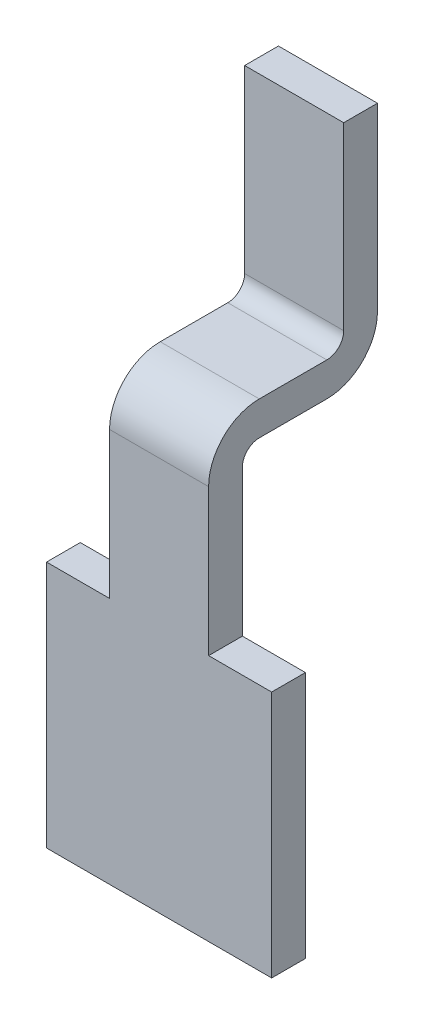
ISO-10303-21;
HEADER;
FILE_DESCRIPTION(('STEP AP214'),'2;1');
FILE_NAME('part.step','',(''),(''),'','','');
FILE_SCHEMA(('AUTOMOTIVE_DESIGN { 1 0 10303 214 1 1 1 1 }'));
ENDSEC;
DATA;
#1=APPLICATION_CONTEXT('core data for automotive mechanical design processes');
#2=APPLICATION_PROTOCOL_DEFINITION('international standard','automotive_design',2000,#1);
#3=PRODUCT_CONTEXT('',#1,'mechanical');
#4=PRODUCT('Part','Part','',(#3));
#5=PRODUCT_RELATED_PRODUCT_CATEGORY('part','',(#4));
#6=PRODUCT_DEFINITION_FORMATION('','',#4);
#7=PRODUCT_DEFINITION_CONTEXT('part definition',#1,'design');
#8=PRODUCT_DEFINITION('design','',#6,#7);
#9=PRODUCT_DEFINITION_SHAPE('','',#8);
#10=(LENGTH_UNIT() NAMED_UNIT(*) SI_UNIT(.MILLI.,.METRE.));
#11=(NAMED_UNIT(*) PLANE_ANGLE_UNIT() SI_UNIT($,.RADIAN.));
#12=(NAMED_UNIT(*) SI_UNIT($,.STERADIAN.) SOLID_ANGLE_UNIT());
#13=UNCERTAINTY_MEASURE_WITH_UNIT(LENGTH_MEASURE(1.E-05),#10,'distance_accuracy_value','');
#14=(GEOMETRIC_REPRESENTATION_CONTEXT(3) GLOBAL_UNCERTAINTY_ASSIGNED_CONTEXT((#13)) GLOBAL_UNIT_ASSIGNED_CONTEXT((#10,
#11,#12)) REPRESENTATION_CONTEXT('',''));
#15=CARTESIAN_POINT('',(0.,0.,0.));
#16=DIRECTION('',(0.,0.,1.));
#17=DIRECTION('',(1.,0.,0.));
#18=AXIS2_PLACEMENT_3D('',#15,#16,#17);
#19=CARTESIAN_POINT('',(0.,2.9,-0.075));
#20=DIRECTION('',(1.,0.,0.));
#21=DIRECTION('',(0.,1.,0.));
#22=AXIS2_PLACEMENT_3D('',#19,#20,#21);
#23=CYLINDRICAL_SURFACE('',#22,0.225);
#24=CARTESIAN_POINT('',(0.22,2.9,-0.075));
#25=DIRECTION('',(1.,0.,0.));
#26=DIRECTION('',(0.,1.,0.));
#27=AXIS2_PLACEMENT_3D('',#24,#25,#26);
#28=CIRCLE('',#27,0.225);
#29=CARTESIAN_POINT('',(0.22,3.125,-0.075));
#30=VERTEX_POINT('',#29);
#31=CARTESIAN_POINT('',(0.22,2.9,0.15));
#32=VERTEX_POINT('',#31);
#33=EDGE_CURVE('E269',#30,#32,#28,.T.);
#34=ORIENTED_EDGE('',*,*,#33,.F.);
#35=DIRECTION('',(1.,0.,0.));
#36=VECTOR('',#35,1.);
#37=CARTESIAN_POINT('',(-0.22,3.125,-0.075));
#38=LINE('',#37,#36);
#39=CARTESIAN_POINT('',(-0.22,3.125,-0.075));
#40=VERTEX_POINT('',#39);
#41=EDGE_CURVE('E246',#30,#40,#38,.F.);
#42=ORIENTED_EDGE('',*,*,#41,.T.);
#43=CARTESIAN_POINT('',(-0.22,2.9,-0.075));
#44=DIRECTION('',(1.,0.,0.));
#45=DIRECTION('',(0.,1.,0.));
#46=AXIS2_PLACEMENT_3D('',#43,#44,#45);
#47=CIRCLE('',#46,0.225);
#48=CARTESIAN_POINT('',(-0.22,2.9,0.15));
#49=VERTEX_POINT('',#48);
#50=EDGE_CURVE('E266',#49,#40,#47,.F.);
#51=ORIENTED_EDGE('',*,*,#50,.F.);
#52=DIRECTION('',(1.,0.,0.));
#53=VECTOR('',#52,1.);
#54=CARTESIAN_POINT('',(-0.5,2.9,0.15));
#55=LINE('',#54,#53);
#56=EDGE_CURVE('E207',#32,#49,#55,.F.);
#57=ORIENTED_EDGE('',*,*,#56,.F.);
#58=EDGE_LOOP('',(#34,#42,#51,#57));
#59=FACE_BOUND('',#58,.T.);
#60=ADVANCED_FACE('F17',(#59),#23,.T.);
#61=CARTESIAN_POINT('',(-0.22,3.125,-0.075));
#62=DIRECTION('',(0.,-1.,0.));
#63=DIRECTION('',(0.,0.,-1.));
#64=AXIS2_PLACEMENT_3D('',#61,#62,#63);
#65=PLANE('',#64);
#66=ORIENTED_EDGE('',*,*,#41,.F.);
#67=DIRECTION('',(0.,0.,-1.));
#68=VECTOR('',#67,1.);
#69=CARTESIAN_POINT('',(0.22,3.125,0.15));
#70=LINE('',#69,#68);
#71=CARTESIAN_POINT('',(0.22,3.125,-0.375));
#72=VERTEX_POINT('',#71);
#73=EDGE_CURVE('E270',#72,#30,#70,.F.);
#74=ORIENTED_EDGE('',*,*,#73,.F.);
#75=DIRECTION('',(-1.,0.,0.));
#76=VECTOR('',#75,1.);
#77=CARTESIAN_POINT('',(0.,3.125,-0.375));
#78=LINE('',#77,#76);
#79=CARTESIAN_POINT('',(-0.22,3.125,-0.375));
#80=VERTEX_POINT('',#79);
#81=EDGE_CURVE('E243',#72,#80,#78,.T.);
#82=ORIENTED_EDGE('',*,*,#81,.T.);
#83=DIRECTION('',(0.,0.,1.));
#84=VECTOR('',#83,1.);
#85=CARTESIAN_POINT('',(-0.22,3.125,0.15));
#86=LINE('',#85,#84);
#87=EDGE_CURVE('E265',#40,#80,#86,.F.);
#88=ORIENTED_EDGE('',*,*,#87,.F.);
#89=EDGE_LOOP('',(#66,#74,#82,#88));
#90=FACE_BOUND('',#89,.T.);
#91=ADVANCED_FACE('F351',(#90),#65,.F.);
#92=CARTESIAN_POINT('',(0.,3.2,-0.375));
#93=DIRECTION('',(-1.,0.,0.));
#94=DIRECTION('',(0.,-1.,0.));
#95=AXIS2_PLACEMENT_3D('',#92,#93,#94);
#96=CYLINDRICAL_SURFACE('',#95,0.075);
#97=ORIENTED_EDGE('',*,*,#81,.F.);
#98=CARTESIAN_POINT('',(0.22,3.2,-0.375));
#99=DIRECTION('',(-1.,0.,0.));
#100=DIRECTION('',(0.,-1.,0.));
#101=AXIS2_PLACEMENT_3D('',#98,#99,#100);
#102=CIRCLE('',#101,0.075);
#103=CARTESIAN_POINT('',(0.22,3.2,-0.45));
#104=VERTEX_POINT('',#103);
#105=EDGE_CURVE('E271',#104,#72,#102,.T.);
#106=ORIENTED_EDGE('',*,*,#105,.F.);
#107=DIRECTION('',(1.,0.,0.));
#108=VECTOR('',#107,1.);
#109=CARTESIAN_POINT('',(-0.22,3.2,-0.45));
#110=LINE('',#109,#108);
#111=CARTESIAN_POINT('',(-0.22,3.2,-0.45));
#112=VERTEX_POINT('',#111);
#113=EDGE_CURVE('E238',#104,#112,#110,.F.);
#114=ORIENTED_EDGE('',*,*,#113,.T.);
#115=CARTESIAN_POINT('',(-0.22,3.2,-0.375));
#116=DIRECTION('',(-1.,0.,0.));
#117=DIRECTION('',(0.,-1.,0.));
#118=AXIS2_PLACEMENT_3D('',#115,#116,#117);
#119=CIRCLE('',#118,0.075);
#120=EDGE_CURVE('E263',#80,#112,#119,.F.);
#121=ORIENTED_EDGE('',*,*,#120,.F.);
#122=EDGE_LOOP('',(#97,#106,#114,#121));
#123=FACE_BOUND('',#122,.T.);
#124=ADVANCED_FACE('F356',(#123),#96,.F.);
#125=CARTESIAN_POINT('',(-0.22,3.2,-0.45));
#126=DIRECTION('',(0.,0.,-1.));
#127=DIRECTION('',(0.,1.,0.));
#128=AXIS2_PLACEMENT_3D('',#125,#126,#127);
#129=PLANE('',#128);
#130=ORIENTED_EDGE('',*,*,#113,.F.);
#131=DIRECTION('',(0.,1.,0.));
#132=VECTOR('',#131,1.);
#133=CARTESIAN_POINT('',(0.22,2.75,-0.45));
#134=LINE('',#133,#132);
#135=CARTESIAN_POINT('',(0.22,4.,-0.45));
#136=VERTEX_POINT('',#135);
#137=EDGE_CURVE('E154',#136,#104,#134,.F.);
#138=ORIENTED_EDGE('',*,*,#137,.F.);
#139=DIRECTION('',(1.,0.,0.));
#140=VECTOR('',#139,1.);
#141=CARTESIAN_POINT('',(0.,4.,-0.45));
#142=LINE('',#141,#140);
#143=CARTESIAN_POINT('',(-0.22,4.,-0.45));
#144=VERTEX_POINT('',#143);
#145=EDGE_CURVE('E228',#144,#136,#142,.T.);
#146=ORIENTED_EDGE('',*,*,#145,.F.);
#147=DIRECTION('',(0.,1.,0.));
#148=VECTOR('',#147,1.);
#149=CARTESIAN_POINT('',(-0.22,2.25,-0.45));
#150=LINE('',#149,#148);
#151=EDGE_CURVE('E234',#112,#144,#150,.T.);
#152=ORIENTED_EDGE('',*,*,#151,.F.);
#153=EDGE_LOOP('',(#130,#138,#146,#152));
#154=FACE_BOUND('',#153,.T.);
#155=ADVANCED_FACE('F358',(#154),#129,.F.);
#156=CARTESIAN_POINT('',(0.,4.,-0.525));
#157=DIRECTION('',(0.,1.,0.));
#158=DIRECTION('',(0.,0.,1.));
#159=AXIS2_PLACEMENT_3D('',#156,#157,#158);
#160=PLANE('',#159);
#161=ORIENTED_EDGE('',*,*,#145,.T.);
#162=DIRECTION('',(0.,0.,-1.));
#163=VECTOR('',#162,1.);
#164=CARTESIAN_POINT('',(0.22,4.,0.15));
#165=LINE('',#164,#163);
#166=CARTESIAN_POINT('',(0.22,4.,-0.6));
#167=VERTEX_POINT('',#166);
#168=EDGE_CURVE('E152',#167,#136,#165,.F.);
#169=ORIENTED_EDGE('',*,*,#168,.F.);
#170=DIRECTION('',(1.,0.,0.));
#171=VECTOR('',#170,1.);
#172=CARTESIAN_POINT('',(0.22,4.,-0.6));
#173=LINE('',#172,#171);
#174=CARTESIAN_POINT('',(-0.22,4.,-0.6));
#175=VERTEX_POINT('',#174);
#176=EDGE_CURVE('E140',#167,#175,#173,.F.);
#177=ORIENTED_EDGE('',*,*,#176,.T.);
#178=DIRECTION('',(0.,0.,1.));
#179=VECTOR('',#178,1.);
#180=CARTESIAN_POINT('',(-0.22,4.,0.15));
#181=LINE('',#180,#179);
#182=EDGE_CURVE('E231',#144,#175,#181,.F.);
#183=ORIENTED_EDGE('',*,*,#182,.F.);
#184=EDGE_LOOP('',(#161,#169,#177,#183));
#185=FACE_BOUND('',#184,.T.);
#186=ADVANCED_FACE('F361',(#185),#160,.T.);
#187=CARTESIAN_POINT('',(0.22,3.2,-0.6));
#188=DIRECTION('',(0.,0.,1.));
#189=DIRECTION('',(0.,-1.,0.));
#190=AXIS2_PLACEMENT_3D('',#187,#188,#189);
#191=PLANE('',#190);
#192=DIRECTION('',(0.,1.,0.));
#193=VECTOR('',#192,1.);
#194=CARTESIAN_POINT('',(0.22,2.75,-0.6));
#195=LINE('',#194,#193);
#196=CARTESIAN_POINT('',(0.22,3.2,-0.6));
#197=VERTEX_POINT('',#196);
#198=EDGE_CURVE('E146',#197,#167,#195,.T.);
#199=ORIENTED_EDGE('',*,*,#198,.F.);
#200=DIRECTION('',(-1.,0.,0.));
#201=VECTOR('',#200,1.);
#202=CARTESIAN_POINT('',(0.,3.2,-0.6));
#203=LINE('',#202,#201);
#204=CARTESIAN_POINT('',(-0.22,3.2,-0.6));
#205=VERTEX_POINT('',#204);
#206=EDGE_CURVE('E133',#205,#197,#203,.F.);
#207=ORIENTED_EDGE('',*,*,#206,.F.);
#208=DIRECTION('',(0.,1.,0.));
#209=VECTOR('',#208,1.);
#210=CARTESIAN_POINT('',(-0.22,2.25,-0.6));
#211=LINE('',#210,#209);
#212=EDGE_CURVE('E233',#175,#205,#211,.F.);
#213=ORIENTED_EDGE('',*,*,#212,.F.);
#214=ORIENTED_EDGE('',*,*,#176,.F.);
#215=EDGE_LOOP('',(#199,#207,#213,#214));
#216=FACE_BOUND('',#215,.T.);
#217=ADVANCED_FACE('F150',(#216),#191,.F.);
#218=CARTESIAN_POINT('',(0.,3.2,-0.375));
#219=DIRECTION('',(-1.,0.,0.));
#220=DIRECTION('',(0.,-1.,0.));
#221=AXIS2_PLACEMENT_3D('',#218,#219,#220);
#222=CYLINDRICAL_SURFACE('',#221,0.225);
#223=DIRECTION('',(1.,0.,0.));
#224=VECTOR('',#223,1.);
#225=CARTESIAN_POINT('',(0.22,2.975,-0.375));
#226=LINE('',#225,#224);
#227=CARTESIAN_POINT('',(0.22,2.975,-0.375));
#228=VERTEX_POINT('',#227);
#229=CARTESIAN_POINT('',(-0.22,2.975,-0.375));
#230=VERTEX_POINT('',#229);
#231=EDGE_CURVE('E126',#228,#230,#226,.F.);
#232=ORIENTED_EDGE('',*,*,#231,.T.);
#233=CARTESIAN_POINT('',(-0.22,3.2,-0.375));
#234=DIRECTION('',(-1.,0.,0.));
#235=DIRECTION('',(0.,-1.,0.));
#236=AXIS2_PLACEMENT_3D('',#233,#234,#235);
#237=CIRCLE('',#236,0.225);
#238=EDGE_CURVE('E136',#205,#230,#237,.T.);
#239=ORIENTED_EDGE('',*,*,#238,.F.);
#240=ORIENTED_EDGE('',*,*,#206,.T.);
#241=CARTESIAN_POINT('',(0.22,3.2,-0.375));
#242=DIRECTION('',(-1.,0.,0.));
#243=DIRECTION('',(0.,-1.,0.));
#244=AXIS2_PLACEMENT_3D('',#241,#242,#243);
#245=CIRCLE('',#244,0.225);
#246=EDGE_CURVE('E20',#228,#197,#245,.F.);
#247=ORIENTED_EDGE('',*,*,#246,.F.);
#248=EDGE_LOOP('',(#232,#239,#240,#247));
#249=FACE_BOUND('',#248,.T.);
#250=ADVANCED_FACE('F135',(#249),#222,.T.);
#251=CARTESIAN_POINT('',(0.22,2.975,-0.075));
#252=DIRECTION('',(0.,1.,0.));
#253=DIRECTION('',(0.,0.,1.));
#254=AXIS2_PLACEMENT_3D('',#251,#252,#253);
#255=PLANE('',#254);
#256=DIRECTION('',(0.,0.,-1.));
#257=VECTOR('',#256,1.);
#258=CARTESIAN_POINT('',(0.22,2.975,0.15));
#259=LINE('',#258,#257);
#260=CARTESIAN_POINT('',(0.22,2.975,-0.075));
#261=VERTEX_POINT('',#260);
#262=EDGE_CURVE('E149',#261,#228,#259,.T.);
#263=ORIENTED_EDGE('',*,*,#262,.F.);
#264=DIRECTION('',(1.,0.,0.));
#265=VECTOR('',#264,1.);
#266=CARTESIAN_POINT('',(0.,2.975,-0.075));
#267=LINE('',#266,#265);
#268=CARTESIAN_POINT('',(-0.22,2.975,-0.075));
#269=VERTEX_POINT('',#268);
#270=EDGE_CURVE('E222',#261,#269,#267,.F.);
#271=ORIENTED_EDGE('',*,*,#270,.T.);
#272=DIRECTION('',(0.,0.,1.));
#273=VECTOR('',#272,1.);
#274=CARTESIAN_POINT('',(-0.22,2.975,0.15));
#275=LINE('',#274,#273);
#276=EDGE_CURVE('E261',#230,#269,#275,.T.);
#277=ORIENTED_EDGE('',*,*,#276,.F.);
#278=ORIENTED_EDGE('',*,*,#231,.F.);
#279=EDGE_LOOP('',(#263,#271,#277,#278));
#280=FACE_BOUND('',#279,.T.);
#281=ADVANCED_FACE('F319',(#280),#255,.F.);
#282=CARTESIAN_POINT('',(-0.5,1.15,0.15));
#283=DIRECTION('',(0.,0.,1.));
#284=DIRECTION('',(1.,0.,0.));
#285=AXIS2_PLACEMENT_3D('',#282,#283,#284);
#286=PLANE('',#285);
#287=DIRECTION('',(0.,1.,0.));
#288=VECTOR('',#287,1.);
#289=CARTESIAN_POINT('',(-0.22,2.25,0.15));
#290=LINE('',#289,#288);
#291=CARTESIAN_POINT('',(-0.22,2.25,0.15));
#292=VERTEX_POINT('',#291);
#293=EDGE_CURVE('E225',#292,#49,#290,.T.);
#294=ORIENTED_EDGE('',*,*,#293,.F.);
#295=DIRECTION('',(1.,0.,0.));
#296=VECTOR('',#295,1.);
#297=CARTESIAN_POINT('',(0.5,2.25,0.15));
#298=LINE('',#297,#296);
#299=CARTESIAN_POINT('',(-0.5,2.25,0.15));
#300=VERTEX_POINT('',#299);
#301=EDGE_CURVE('E215',#292,#300,#298,.F.);
#302=ORIENTED_EDGE('',*,*,#301,.T.);
#303=DIRECTION('',(0.,1.,0.));
#304=VECTOR('',#303,1.);
#305=CARTESIAN_POINT('',(-0.5,2.25,0.15));
#306=LINE('',#305,#304);
#307=CARTESIAN_POINT('',(-0.5,1.15,0.15));
#308=VERTEX_POINT('',#307);
#309=EDGE_CURVE('E201',#300,#308,#306,.F.);
#310=ORIENTED_EDGE('',*,*,#309,.T.);
#311=DIRECTION('',(1.,0.,0.));
#312=VECTOR('',#311,1.);
#313=CARTESIAN_POINT('',(-0.5,1.15,0.15));
#314=LINE('',#313,#312);
#315=CARTESIAN_POINT('',(0.5,1.15,0.15));
#316=VERTEX_POINT('',#315);
#317=EDGE_CURVE('E191',#308,#316,#314,.T.);
#318=ORIENTED_EDGE('',*,*,#317,.T.);
#319=DIRECTION('',(0.,1.,0.));
#320=VECTOR('',#319,1.);
#321=CARTESIAN_POINT('',(0.5,1.15,0.15));
#322=LINE('',#321,#320);
#323=CARTESIAN_POINT('',(0.5,2.25,0.15));
#324=VERTEX_POINT('',#323);
#325=EDGE_CURVE('E180',#316,#324,#322,.T.);
#326=ORIENTED_EDGE('',*,*,#325,.T.);
#327=DIRECTION('',(1.,0.,0.));
#328=VECTOR('',#327,1.);
#329=CARTESIAN_POINT('',(0.5,2.25,0.15));
#330=LINE('',#329,#328);
#331=CARTESIAN_POINT('',(0.22,2.25,0.15));
#332=VERTEX_POINT('',#331);
#333=EDGE_CURVE('E163',#324,#332,#330,.F.);
#334=ORIENTED_EDGE('',*,*,#333,.T.);
#335=DIRECTION('',(0.,1.,0.));
#336=VECTOR('',#335,1.);
#337=CARTESIAN_POINT('',(0.22,2.75,0.15));
#338=LINE('',#337,#336);
#339=EDGE_CURVE('E167',#32,#332,#338,.F.);
#340=ORIENTED_EDGE('',*,*,#339,.F.);
#341=ORIENTED_EDGE('',*,*,#56,.T.);
#342=EDGE_LOOP('',(#294,#302,#310,#318,#326,#334,#340,#341));
#343=FACE_BOUND('',#342,.T.);
#344=ADVANCED_FACE('F393',(#343),#286,.T.);
#345=CARTESIAN_POINT('',(-0.5,1.15,0.15));
#346=DIRECTION('',(0.,1.,0.));
#347=DIRECTION('',(0.,0.,1.));
#348=AXIS2_PLACEMENT_3D('',#345,#346,#347);
#349=PLANE('',#348);
#350=DIRECTION('',(0.,0.,1.));
#351=VECTOR('',#350,1.);
#352=CARTESIAN_POINT('',(0.5,1.15,0.15));
#353=LINE('',#352,#351);
#354=CARTESIAN_POINT('',(0.5,1.15,0.));
#355=VERTEX_POINT('',#354);
#356=EDGE_CURVE('E188',#355,#316,#353,.T.);
#357=ORIENTED_EDGE('',*,*,#356,.T.);
#358=ORIENTED_EDGE('',*,*,#317,.F.);
#359=DIRECTION('',(0.,0.,-1.));
#360=VECTOR('',#359,1.);
#361=CARTESIAN_POINT('',(-0.5,1.15,0.15));
#362=LINE('',#361,#360);
#363=CARTESIAN_POINT('',(-0.5,1.15,0.));
#364=VERTEX_POINT('',#363);
#365=EDGE_CURVE('E196',#308,#364,#362,.T.);
#366=ORIENTED_EDGE('',*,*,#365,.T.);
#367=DIRECTION('',(1.,0.,0.));
#368=VECTOR('',#367,1.);
#369=CARTESIAN_POINT('',(-0.5,1.15,0.));
#370=LINE('',#369,#368);
#371=EDGE_CURVE('E185',#364,#355,#370,.T.);
#372=ORIENTED_EDGE('',*,*,#371,.T.);
#373=EDGE_LOOP('',(#357,#358,#366,#372));
#374=FACE_BOUND('',#373,.T.);
#375=ADVANCED_FACE('F339',(#374),#349,.F.);
#376=CARTESIAN_POINT('',(0.5,1.15,0.15));
#377=DIRECTION('',(-1.,0.,0.));
#378=DIRECTION('',(0.,0.,1.));
#379=AXIS2_PLACEMENT_3D('',#376,#377,#378);
#380=PLANE('',#379);
#381=DIRECTION('',(0.,0.,-1.));
#382=VECTOR('',#381,1.);
#383=CARTESIAN_POINT('',(0.5,2.25,0.15));
#384=LINE('',#383,#382);
#385=CARTESIAN_POINT('',(0.5,2.25,0.));
#386=VERTEX_POINT('',#385);
#387=EDGE_CURVE('E177',#386,#324,#384,.F.);
#388=ORIENTED_EDGE('',*,*,#387,.T.);
#389=ORIENTED_EDGE('',*,*,#325,.F.);
#390=ORIENTED_EDGE('',*,*,#356,.F.);
#391=DIRECTION('',(0.,1.,0.));
#392=VECTOR('',#391,1.);
#393=CARTESIAN_POINT('',(0.5,1.15,0.));
#394=LINE('',#393,#392);
#395=EDGE_CURVE('E174',#355,#386,#394,.T.);
#396=ORIENTED_EDGE('',*,*,#395,.T.);
#397=EDGE_LOOP('',(#388,#389,#390,#396));
#398=FACE_BOUND('',#397,.T.);
#399=ADVANCED_FACE('F336',(#398),#380,.F.);
#400=CARTESIAN_POINT('',(0.5,2.25,0.15));
#401=DIRECTION('',(0.,-1.,0.));
#402=DIRECTION('',(0.,0.,-1.));
#403=AXIS2_PLACEMENT_3D('',#400,#401,#402);
#404=PLANE('',#403);
#405=ORIENTED_EDGE('',*,*,#333,.F.);
#406=ORIENTED_EDGE('',*,*,#387,.F.);
#407=DIRECTION('',(1.,0.,0.));
#408=VECTOR('',#407,1.);
#409=CARTESIAN_POINT('',(-0.5,2.25,0.));
#410=LINE('',#409,#408);
#411=CARTESIAN_POINT('',(0.22,2.25,0.));
#412=VERTEX_POINT('',#411);
#413=EDGE_CURVE('E170',#386,#412,#410,.F.);
#414=ORIENTED_EDGE('',*,*,#413,.T.);
#415=DIRECTION('',(0.,0.,-1.));
#416=VECTOR('',#415,1.);
#417=CARTESIAN_POINT('',(0.22,2.25,0.15));
#418=LINE('',#417,#416);
#419=EDGE_CURVE('E164',#332,#412,#418,.T.);
#420=ORIENTED_EDGE('',*,*,#419,.F.);
#421=EDGE_LOOP('',(#405,#406,#414,#420));
#422=FACE_BOUND('',#421,.T.);
#423=ADVANCED_FACE('F332',(#422),#404,.F.);
#424=CARTESIAN_POINT('',(0.22,2.75,0.15));
#425=DIRECTION('',(1.,0.,0.));
#426=DIRECTION('',(0.,0.,-1.));
#427=AXIS2_PLACEMENT_3D('',#424,#425,#426);
#428=PLANE('',#427);
#429=ORIENTED_EDGE('',*,*,#339,.T.);
#430=ORIENTED_EDGE('',*,*,#419,.T.);
#431=DIRECTION('',(0.,1.,0.));
#432=VECTOR('',#431,1.);
#433=CARTESIAN_POINT('',(0.22,1.15,0.));
#434=LINE('',#433,#432);
#435=CARTESIAN_POINT('',(0.22,2.9,0.));
#436=VERTEX_POINT('',#435);
#437=EDGE_CURVE('E173',#412,#436,#434,.T.);
#438=ORIENTED_EDGE('',*,*,#437,.T.);
#439=CARTESIAN_POINT('',(0.22,2.9,-0.075));
#440=DIRECTION('',(1.,0.,0.));
#441=DIRECTION('',(0.,1.,0.));
#442=AXIS2_PLACEMENT_3D('',#439,#440,#441);
#443=CIRCLE('',#442,0.075);
#444=EDGE_CURVE('E166',#436,#261,#443,.F.);
#445=ORIENTED_EDGE('',*,*,#444,.T.);
#446=ORIENTED_EDGE('',*,*,#262,.T.);
#447=ORIENTED_EDGE('',*,*,#246,.T.);
#448=ORIENTED_EDGE('',*,*,#198,.T.);
#449=ORIENTED_EDGE('',*,*,#168,.T.);
#450=ORIENTED_EDGE('',*,*,#137,.T.);
#451=ORIENTED_EDGE('',*,*,#105,.T.);
#452=ORIENTED_EDGE('',*,*,#73,.T.);
#453=ORIENTED_EDGE('',*,*,#33,.T.);
#454=EDGE_LOOP('',(#429,#430,#438,#445,#446,#447,#448,#449,#450,#451,#452,#453));
#455=FACE_BOUND('',#454,.T.);
#456=ADVANCED_FACE('F144',(#455),#428,.T.);
#457=CARTESIAN_POINT('',(0.,2.9,-0.075));
#458=DIRECTION('',(1.,0.,0.));
#459=DIRECTION('',(0.,1.,0.));
#460=AXIS2_PLACEMENT_3D('',#457,#458,#459);
#461=CYLINDRICAL_SURFACE('',#460,0.075);
#462=ORIENTED_EDGE('',*,*,#444,.F.);
#463=DIRECTION('',(1.,0.,0.));
#464=VECTOR('',#463,1.);
#465=CARTESIAN_POINT('',(-0.5,2.9,0.));
#466=LINE('',#465,#464);
#467=CARTESIAN_POINT('',(-0.22,2.9,0.));
#468=VERTEX_POINT('',#467);
#469=EDGE_CURVE('E287',#436,#468,#466,.F.);
#470=ORIENTED_EDGE('',*,*,#469,.T.);
#471=CARTESIAN_POINT('',(-0.22,2.9,-0.075));
#472=DIRECTION('',(1.,0.,0.));
#473=DIRECTION('',(0.,1.,0.));
#474=AXIS2_PLACEMENT_3D('',#471,#472,#473);
#475=CIRCLE('',#474,0.075);
#476=EDGE_CURVE('E259',#269,#468,#475,.T.);
#477=ORIENTED_EDGE('',*,*,#476,.F.);
#478=ORIENTED_EDGE('',*,*,#270,.F.);
#479=EDGE_LOOP('',(#462,#470,#477,#478));
#480=FACE_BOUND('',#479,.T.);
#481=ADVANCED_FACE('F321',(#480),#461,.F.);
#482=CARTESIAN_POINT('',(-0.22,2.25,0.15));
#483=DIRECTION('',(-1.,0.,0.));
#484=DIRECTION('',(0.,0.,1.));
#485=AXIS2_PLACEMENT_3D('',#482,#483,#484);
#486=PLANE('',#485);
#487=ORIENTED_EDGE('',*,*,#276,.T.);
#488=ORIENTED_EDGE('',*,*,#476,.T.);
#489=DIRECTION('',(0.,1.,0.));
#490=VECTOR('',#489,1.);
#491=CARTESIAN_POINT('',(-0.22,1.15,0.));
#492=LINE('',#491,#490);
#493=CARTESIAN_POINT('',(-0.22,2.25,0.));
#494=VERTEX_POINT('',#493);
#495=EDGE_CURVE('E296',#468,#494,#492,.F.);
#496=ORIENTED_EDGE('',*,*,#495,.T.);
#497=DIRECTION('',(0.,0.,-1.));
#498=VECTOR('',#497,1.);
#499=CARTESIAN_POINT('',(-0.22,2.25,0.15));
#500=LINE('',#499,#498);
#501=EDGE_CURVE('E219',#494,#292,#500,.F.);
#502=ORIENTED_EDGE('',*,*,#501,.T.);
#503=ORIENTED_EDGE('',*,*,#293,.T.);
#504=ORIENTED_EDGE('',*,*,#50,.T.);
#505=ORIENTED_EDGE('',*,*,#87,.T.);
#506=ORIENTED_EDGE('',*,*,#120,.T.);
#507=ORIENTED_EDGE('',*,*,#151,.T.);
#508=ORIENTED_EDGE('',*,*,#182,.T.);
#509=ORIENTED_EDGE('',*,*,#212,.T.);
#510=ORIENTED_EDGE('',*,*,#238,.T.);
#511=EDGE_LOOP('',(#487,#488,#496,#502,#503,#504,#505,#506,#507,#508,#509,#510));
#512=FACE_BOUND('',#511,.T.);
#513=ADVANCED_FACE('F315',(#512),#486,.T.);
#514=CARTESIAN_POINT('',(0.5,2.25,0.15));
#515=DIRECTION('',(0.,-1.,0.));
#516=DIRECTION('',(0.,0.,-1.));
#517=AXIS2_PLACEMENT_3D('',#514,#515,#516);
#518=PLANE('',#517);
#519=ORIENTED_EDGE('',*,*,#501,.F.);
#520=DIRECTION('',(1.,0.,0.));
#521=VECTOR('',#520,1.);
#522=CARTESIAN_POINT('',(-0.5,2.25,0.));
#523=LINE('',#522,#521);
#524=CARTESIAN_POINT('',(-0.5,2.25,0.));
#525=VERTEX_POINT('',#524);
#526=EDGE_CURVE('E26',#494,#525,#523,.F.);
#527=ORIENTED_EDGE('',*,*,#526,.T.);
#528=DIRECTION('',(0.,0.,-1.));
#529=VECTOR('',#528,1.);
#530=CARTESIAN_POINT('',(-0.5,2.25,0.15));
#531=LINE('',#530,#529);
#532=EDGE_CURVE('E34',#525,#300,#531,.F.);
#533=ORIENTED_EDGE('',*,*,#532,.T.);
#534=ORIENTED_EDGE('',*,*,#301,.F.);
#535=EDGE_LOOP('',(#519,#527,#533,#534));
#536=FACE_BOUND('',#535,.T.);
#537=ADVANCED_FACE('F342',(#536),#518,.F.);
#538=CARTESIAN_POINT('',(-0.5,2.25,0.15));
#539=DIRECTION('',(1.,0.,0.));
#540=DIRECTION('',(0.,0.,-1.));
#541=AXIS2_PLACEMENT_3D('',#538,#539,#540);
#542=PLANE('',#541);
#543=ORIENTED_EDGE('',*,*,#365,.F.);
#544=ORIENTED_EDGE('',*,*,#309,.F.);
#545=ORIENTED_EDGE('',*,*,#532,.F.);
#546=DIRECTION('',(0.,1.,0.));
#547=VECTOR('',#546,1.);
#548=CARTESIAN_POINT('',(-0.5,1.15,0.));
#549=LINE('',#548,#547);
#550=EDGE_CURVE('E11',#525,#364,#549,.F.);
#551=ORIENTED_EDGE('',*,*,#550,.T.);
#552=EDGE_LOOP('',(#543,#544,#545,#551));
#553=FACE_BOUND('',#552,.T.);
#554=ADVANCED_FACE('F372',(#553),#542,.F.);
#555=CARTESIAN_POINT('',(-0.5,1.15,0.));
#556=DIRECTION('',(0.,0.,1.));
#557=DIRECTION('',(1.,0.,0.));
#558=AXIS2_PLACEMENT_3D('',#555,#556,#557);
#559=PLANE('',#558);
#560=ORIENTED_EDGE('',*,*,#526,.F.);
#561=ORIENTED_EDGE('',*,*,#495,.F.);
#562=ORIENTED_EDGE('',*,*,#469,.F.);
#563=ORIENTED_EDGE('',*,*,#437,.F.);
#564=ORIENTED_EDGE('',*,*,#413,.F.);
#565=ORIENTED_EDGE('',*,*,#395,.F.);
#566=ORIENTED_EDGE('',*,*,#371,.F.);
#567=ORIENTED_EDGE('',*,*,#550,.F.);
#568=EDGE_LOOP('',(#560,#561,#562,#563,#564,#565,#566,#567));
#569=FACE_BOUND('',#568,.T.);
#570=ADVANCED_FACE('F326',(#569),#559,.F.);
#571=CLOSED_SHELL('',(#60,#91,#124,#155,#186,#217,#250,#281,#344,#375,#399,#423,#456,#481,#513,
#537,#554,#570));
#572=MANIFOLD_SOLID_BREP('B1',#571);
#573=ADVANCED_BREP_SHAPE_REPRESENTATION('',(#18,#572),#14);
#574=SHAPE_DEFINITION_REPRESENTATION(#9,#573);
ENDSEC;
END-ISO-10303-21;
